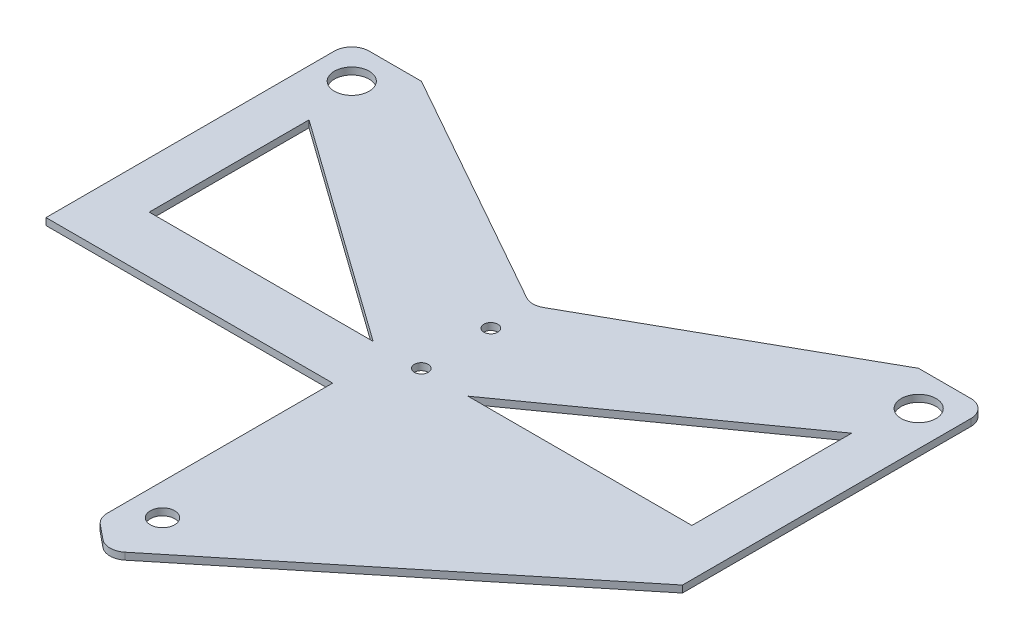
ISO-10303-21;
HEADER;
FILE_DESCRIPTION(('STEP AP214'),'2;1');
FILE_NAME('part.step','',(''),(''),'','','');
FILE_SCHEMA(('AUTOMOTIVE_DESIGN { 1 0 10303 214 1 1 1 1 }'));
ENDSEC;
DATA;
#1=APPLICATION_CONTEXT('core data for automotive mechanical design processes');
#2=APPLICATION_PROTOCOL_DEFINITION('international standard','automotive_design',2000,#1);
#3=PRODUCT_CONTEXT('',#1,'mechanical');
#4=PRODUCT('Part','Part','',(#3));
#5=PRODUCT_RELATED_PRODUCT_CATEGORY('part','',(#4));
#6=PRODUCT_DEFINITION_FORMATION('','',#4);
#7=PRODUCT_DEFINITION_CONTEXT('part definition',#1,'design');
#8=PRODUCT_DEFINITION('design','',#6,#7);
#9=PRODUCT_DEFINITION_SHAPE('','',#8);
#10=(LENGTH_UNIT() NAMED_UNIT(*) SI_UNIT(.MILLI.,.METRE.));
#11=(NAMED_UNIT(*) PLANE_ANGLE_UNIT() SI_UNIT($,.RADIAN.));
#12=(NAMED_UNIT(*) SI_UNIT($,.STERADIAN.) SOLID_ANGLE_UNIT());
#13=UNCERTAINTY_MEASURE_WITH_UNIT(LENGTH_MEASURE(1.E-05),#10,'distance_accuracy_value','');
#14=(GEOMETRIC_REPRESENTATION_CONTEXT(3) GLOBAL_UNCERTAINTY_ASSIGNED_CONTEXT((#13)) GLOBAL_UNIT_ASSIGNED_CONTEXT((#10,
#11,#12)) REPRESENTATION_CONTEXT('',''));
#15=CARTESIAN_POINT('',(0.,0.,0.));
#16=DIRECTION('',(0.,0.,1.));
#17=DIRECTION('',(1.,0.,0.));
#18=AXIS2_PLACEMENT_3D('',#15,#16,#17);
#19=CARTESIAN_POINT('',(0.,0.,-3.79380550980765));
#20=DIRECTION('',(0.,1.,0.));
#21=DIRECTION('',(-1.,0.,0.));
#22=AXIS2_PLACEMENT_3D('',#19,#20,#21);
#23=PLANE('',#22);
#24=CARTESIAN_POINT('',(0.,-1.04083408558608E-13,27.2061944901924));
#25=DIRECTION('',(0.,1.,0.));
#26=DIRECTION('',(-1.,0.,0.));
#27=AXIS2_PLACEMENT_3D('',#24,#25,#26);
#28=CIRCLE('',#27,1.75);
#29=CARTESIAN_POINT('',(-1.75,-1.04083408558608E-13,27.2061944901924));
#30=VERTEX_POINT('',#29);
#31=EDGE_CURVE('E290',#30,#30,#28,.T.);
#32=ORIENTED_EDGE('',*,*,#31,.T.);
#33=EDGE_LOOP('',(#32));
#34=FACE_BOUND('',#33,.T.);
#35=DIRECTION('',(0.775274546322448,0.,-0.63162439616003));
#36=VECTOR('',#35,1.);
#37=CARTESIAN_POINT('',(19.2312986698302,0.,19.8112617454897));
#38=LINE('',#37,#36);
#39=CARTESIAN_POINT('',(1.57906099040009,-1.29236898960272E-13,34.1927270187042));
#40=VERTEX_POINT('',#39);
#41=CARTESIAN_POINT('',(45.75,0.,-1.79380550980766));
#42=VERTEX_POINT('',#41);
#43=EDGE_CURVE('E267',#40,#42,#38,.T.);
#44=ORIENTED_EDGE('',*,*,#43,.F.);
#45=CARTESIAN_POINT('',(0.,-1.22298005056365E-13,32.2545406528981));
#46=DIRECTION('',(0.,1.,0.));
#47=DIRECTION('',(-1.,0.,0.));
#48=AXIS2_PLACEMENT_3D('',#45,#46,#47);
#49=CIRCLE('',#48,2.5);
#50=CARTESIAN_POINT('',(-1.57906099040009,-1.29236898960272E-13,34.1927270187042));
#51=VERTEX_POINT('',#50);
#52=EDGE_CURVE('E253',#51,#40,#49,.T.);
#53=ORIENTED_EDGE('',*,*,#52,.F.);
#54=DIRECTION('',(0.775274546322448,0.,0.63162439616003));
#55=VECTOR('',#54,1.);
#56=CARTESIAN_POINT('',(-3.61720845473632,-1.23165366794353E-13,32.5322266610528));
#57=LINE('',#56,#55);
#58=CARTESIAN_POINT('',(-3.61720845473632,-1.23165366794353E-13,32.5322266610528));
#59=VERTEX_POINT('',#58);
#60=EDGE_CURVE('E256',#59,#51,#57,.T.);
#61=ORIENTED_EDGE('',*,*,#60,.F.);
#62=CARTESIAN_POINT('',(-2.03814746433627,-1.15792792021452E-13,30.5940402952466));
#63=DIRECTION('',(0.,1.,0.));
#64=DIRECTION('',(-1.,0.,0.));
#65=AXIS2_PLACEMENT_3D('',#62,#63,#64);
#66=CIRCLE('',#65,2.5);
#67=CARTESIAN_POINT('',(-4.53814746433627,-1.15792792021452E-13,30.5940402952466));
#68=VERTEX_POINT('',#67);
#69=EDGE_CURVE('E275',#59,#68,#66,.F.);
#70=ORIENTED_EDGE('',*,*,#69,.T.);
#71=DIRECTION('',(0.,0.,-1.));
#72=VECTOR('',#71,1.);
#73=CARTESIAN_POINT('',(-4.53814746433628,0.,-3.79380550980765));
#74=LINE('',#73,#72);
#75=CARTESIAN_POINT('',(-4.53814746433628,0.,-1.79380550980766));
#76=VERTEX_POINT('',#75);
#77=EDGE_CURVE('E280',#68,#76,#74,.T.);
#78=ORIENTED_EDGE('',*,*,#77,.T.);
#79=DIRECTION('',(1.,0.,0.));
#80=VECTOR('',#79,1.);
#81=CARTESIAN_POINT('',(45.75,0.,-1.79380550980766));
#82=LINE('',#81,#80);
#83=CARTESIAN_POINT('',(-45.75,0.,-1.79380550980766));
#84=VERTEX_POINT('',#83);
#85=EDGE_CURVE('E65',#84,#76,#82,.T.);
#86=ORIENTED_EDGE('',*,*,#85,.F.);
#87=DIRECTION('',(0.,0.,1.));
#88=VECTOR('',#87,1.);
#89=CARTESIAN_POINT('',(-45.75,0.,-2.97190275490383));
#90=LINE('',#89,#88);
#91=CARTESIAN_POINT('',(-45.75,0.,-43.25));
#92=VERTEX_POINT('',#91);
#93=EDGE_CURVE('E202',#92,#84,#90,.T.);
#94=ORIENTED_EDGE('',*,*,#93,.F.);
#95=CARTESIAN_POINT('',(-43.25,0.,-43.25));
#96=DIRECTION('',(0.,1.,0.));
#97=DIRECTION('',(0.,0.,1.));
#98=AXIS2_PLACEMENT_3D('',#95,#96,#97);
#99=CIRCLE('',#98,2.5);
#100=CARTESIAN_POINT('',(-43.25,0.,-45.75));
#101=VERTEX_POINT('',#100);
#102=EDGE_CURVE('E207',#101,#92,#99,.T.);
#103=ORIENTED_EDGE('',*,*,#102,.F.);
#104=DIRECTION('',(1.,0.,0.));
#105=VECTOR('',#104,1.);
#106=CARTESIAN_POINT('',(-43.25,0.,-45.75));
#107=LINE('',#106,#105);
#108=CARTESIAN_POINT('',(-35.737250175444,0.,-45.75));
#109=VERTEX_POINT('',#108);
#110=EDGE_CURVE('E220',#109,#101,#107,.F.);
#111=ORIENTED_EDGE('',*,*,#110,.F.);
#112=DIRECTION('',(-0.87190213853743,0.,-0.4896801617524));
#113=VECTOR('',#112,1.);
#114=CARTESIAN_POINT('',(-40.3811598554617,0.,-48.3581257778415));
#115=LINE('',#114,#113);
#116=CARTESIAN_POINT('',(-1.22420040438101,0.,-26.3666827130253));
#117=VERTEX_POINT('',#116);
#118=EDGE_CURVE('E371',#117,#109,#115,.T.);
#119=ORIENTED_EDGE('',*,*,#118,.F.);
#120=CARTESIAN_POINT('',(0.,0.,-28.5464380593689));
#121=DIRECTION('',(0.,-1.,0.));
#122=DIRECTION('',(0.,0.,-1.));
#123=AXIS2_PLACEMENT_3D('',#120,#121,#122);
#124=CIRCLE('',#123,2.5);
#125=CARTESIAN_POINT('',(1.22420040438101,0.,-26.3666827130253));
#126=VERTEX_POINT('',#125);
#127=EDGE_CURVE('E246',#126,#117,#124,.T.);
#128=ORIENTED_EDGE('',*,*,#127,.F.);
#129=DIRECTION('',(-0.87190213853743,0.,0.4896801617524));
#130=VECTOR('',#129,1.);
#131=CARTESIAN_POINT('',(-25.3772939841398,0.,-11.4266756878364));
#132=LINE('',#131,#130);
#133=CARTESIAN_POINT('',(35.737250175444,0.,-45.75));
#134=VERTEX_POINT('',#133);
#135=EDGE_CURVE('E241',#134,#126,#132,.T.);
#136=ORIENTED_EDGE('',*,*,#135,.F.);
#137=CARTESIAN_POINT('',(43.25,0.,-45.75));
#138=VERTEX_POINT('',#137);
#139=EDGE_CURVE('E237',#138,#134,#107,.F.);
#140=ORIENTED_EDGE('',*,*,#139,.F.);
#141=CARTESIAN_POINT('',(43.25,0.,-43.25));
#142=DIRECTION('',(0.,1.,0.));
#143=DIRECTION('',(0.,0.,1.));
#144=AXIS2_PLACEMENT_3D('',#141,#142,#143);
#145=CIRCLE('',#144,2.5);
#146=CARTESIAN_POINT('',(45.75,0.,-43.25));
#147=VERTEX_POINT('',#146);
#148=EDGE_CURVE('E228',#147,#138,#145,.T.);
#149=ORIENTED_EDGE('',*,*,#148,.F.);
#150=DIRECTION('',(0.,0.,1.));
#151=VECTOR('',#150,1.);
#152=CARTESIAN_POINT('',(45.75,0.,-2.97190275490383));
#153=LINE('',#152,#151);
#154=EDGE_CURVE('E209',#42,#147,#153,.F.);
#155=ORIENTED_EDGE('',*,*,#154,.F.);
#156=EDGE_LOOP('',(#44,#53,#61,#70,#78,#86,#94,#103,#111,#119,#128,#136,#140,#149,#155));
#157=FACE_BOUND('',#156,.T.);
#158=DIRECTION('',(-0.813936751097687,0.,0.580953496600668));
#159=VECTOR('',#158,1.);
#160=CARTESIAN_POINT('',(6.81673799323512,0.,-9.88989745885505));
#161=LINE('',#160,#159);
#162=CARTESIAN_POINT('',(39.0092276891494,0.,-32.8675298460155));
#163=VERTEX_POINT('',#162);
#164=CARTESIAN_POINT('',(6.81673799323512,0.,-9.88989745885505));
#165=VERTEX_POINT('',#164);
#166=EDGE_CURVE('E399',#163,#165,#161,.T.);
#167=ORIENTED_EDGE('',*,*,#166,.T.);
#168=DIRECTION('',(1.,0.,0.));
#169=VECTOR('',#168,1.);
#170=CARTESIAN_POINT('',(-43.25,0.,-9.88989745885505));
#171=LINE('',#170,#169);
#172=CARTESIAN_POINT('',(39.0092276891494,0.,-9.88989745885505));
#173=VERTEX_POINT('',#172);
#174=EDGE_CURVE('E836',#165,#173,#171,.T.);
#175=ORIENTED_EDGE('',*,*,#174,.T.);
#176=DIRECTION('',(0.,0.,-1.));
#177=VECTOR('',#176,1.);
#178=CARTESIAN_POINT('',(39.0092276891494,0.,-43.25));
#179=LINE('',#178,#177);
#180=EDGE_CURVE('E838',#173,#163,#179,.T.);
#181=ORIENTED_EDGE('',*,*,#180,.T.);
#182=EDGE_LOOP('',(#167,#175,#181));
#183=FACE_BOUND('',#182,.T.);
#184=CARTESIAN_POINT('',(-40.75,0.,-40.75));
#185=DIRECTION('',(0.,1.,0.));
#186=DIRECTION('',(0.,0.,1.));
#187=AXIS2_PLACEMENT_3D('',#184,#185,#186);
#188=CIRCLE('',#187,2.5);
#189=CARTESIAN_POINT('',(-40.75,0.,-38.25));
#190=VERTEX_POINT('',#189);
#191=EDGE_CURVE('E840',#190,#190,#188,.T.);
#192=ORIENTED_EDGE('',*,*,#191,.T.);
#193=EDGE_LOOP('',(#192));
#194=FACE_BOUND('',#193,.T.);
#195=CARTESIAN_POINT('',(40.75,0.,-40.75));
#196=DIRECTION('',(0.,1.,0.));
#197=DIRECTION('',(0.,0.,1.));
#198=AXIS2_PLACEMENT_3D('',#195,#196,#197);
#199=CIRCLE('',#198,2.5);
#200=CARTESIAN_POINT('',(40.75,0.,-38.25));
#201=VERTEX_POINT('',#200);
#202=EDGE_CURVE('E845',#201,#201,#199,.T.);
#203=ORIENTED_EDGE('',*,*,#202,.T.);
#204=EDGE_LOOP('',(#203));
#205=FACE_BOUND('',#204,.T.);
#206=DIRECTION('',(1.,0.,0.));
#207=VECTOR('',#206,1.);
#208=CARTESIAN_POINT('',(-43.25,0.,-9.88989745885505));
#209=LINE('',#208,#207);
#210=CARTESIAN_POINT('',(-39.0092276891494,0.,-9.88989745885505));
#211=VERTEX_POINT('',#210);
#212=CARTESIAN_POINT('',(-6.81673799323512,0.,-9.88989745885505));
#213=VERTEX_POINT('',#212);
#214=EDGE_CURVE('E848',#211,#213,#209,.T.);
#215=ORIENTED_EDGE('',*,*,#214,.T.);
#216=DIRECTION('',(-0.813936751097687,0.,-0.580953496600668));
#217=VECTOR('',#216,1.);
#218=CARTESIAN_POINT('',(-6.81673799323512,0.,-9.88989745885505));
#219=LINE('',#218,#217);
#220=CARTESIAN_POINT('',(-39.0092276891494,0.,-32.8675298460155));
#221=VERTEX_POINT('',#220);
#222=EDGE_CURVE('E851',#213,#221,#219,.T.);
#223=ORIENTED_EDGE('',*,*,#222,.T.);
#224=DIRECTION('',(0.,0.,-1.));
#225=VECTOR('',#224,1.);
#226=CARTESIAN_POINT('',(-39.0092276891494,0.,-43.25));
#227=LINE('',#226,#225);
#228=EDGE_CURVE('E210',#221,#211,#227,.F.);
#229=ORIENTED_EDGE('',*,*,#228,.T.);
#230=EDGE_LOOP('',(#215,#223,#229));
#231=FACE_BOUND('',#230,.T.);
#232=CARTESIAN_POINT('',(-4.62608795714914E-06,0.,-10.0000000957812));
#233=DIRECTION('',(0.,-1.,0.));
#234=DIRECTION('',(0.,0.,-1.));
#235=AXIS2_PLACEMENT_3D('',#232,#233,#234);
#236=CIRCLE('',#235,1.);
#237=CARTESIAN_POINT('',(-4.62608795714914E-06,0.,-11.0000000957812));
#238=VERTEX_POINT('',#237);
#239=EDGE_CURVE('E360',#238,#238,#236,.T.);
#240=ORIENTED_EDGE('',*,*,#239,.F.);
#241=EDGE_LOOP('',(#240));
#242=FACE_BOUND('',#241,.T.);
#243=CARTESIAN_POINT('',(-4.62608795714914E-06,0.,-20.0000000957812));
#244=DIRECTION('',(0.,-1.,0.));
#245=DIRECTION('',(0.,0.,-1.));
#246=AXIS2_PLACEMENT_3D('',#243,#244,#245);
#247=CIRCLE('',#246,1.);
#248=CARTESIAN_POINT('',(-4.62608795714914E-06,0.,-21.0000000957812));
#249=VERTEX_POINT('',#248);
#250=EDGE_CURVE('E361',#249,#249,#247,.T.);
#251=ORIENTED_EDGE('',*,*,#250,.F.);
#252=EDGE_LOOP('',(#251));
#253=FACE_BOUND('',#252,.T.);
#254=ADVANCED_FACE('F61',(#34,#157,#183,#194,#205,#231,#242,#253),#23,.F.);
#255=CARTESIAN_POINT('',(-43.25,1.,-43.25));
#256=DIRECTION('',(0.,-1.,0.));
#257=DIRECTION('',(0.,0.,-1.));
#258=AXIS2_PLACEMENT_3D('',#255,#256,#257);
#259=PLANE('',#258);
#260=CARTESIAN_POINT('',(0.,0.999999999999895,27.2061944901924));
#261=DIRECTION('',(0.,1.,0.));
#262=DIRECTION('',(-1.,0.,0.));
#263=AXIS2_PLACEMENT_3D('',#260,#261,#262);
#264=CIRCLE('',#263,1.75);
#265=CARTESIAN_POINT('',(-1.75,0.999999999999895,27.2061944901924));
#266=VERTEX_POINT('',#265);
#267=EDGE_CURVE('E287',#266,#266,#264,.T.);
#268=ORIENTED_EDGE('',*,*,#267,.F.);
#269=EDGE_LOOP('',(#268));
#270=FACE_BOUND('',#269,.T.);
#271=CARTESIAN_POINT('',(-2.03814746433627,0.999999999999884,30.5940402952466));
#272=DIRECTION('',(0.,1.,0.));
#273=DIRECTION('',(-1.,0.,0.));
#274=AXIS2_PLACEMENT_3D('',#271,#272,#273);
#275=CIRCLE('',#274,2.5);
#276=CARTESIAN_POINT('',(-3.61720845473632,0.999999999999877,32.5322266610528));
#277=VERTEX_POINT('',#276);
#278=CARTESIAN_POINT('',(-4.53814746433627,0.999999999999883,30.5940402952466));
#279=VERTEX_POINT('',#278);
#280=EDGE_CURVE('E277',#277,#279,#275,.F.);
#281=ORIENTED_EDGE('',*,*,#280,.F.);
#282=DIRECTION('',(0.775274546322448,0.,0.63162439616003));
#283=VECTOR('',#282,1.);
#284=CARTESIAN_POINT('',(-3.61720845473632,0.999999999999877,32.5322266610528));
#285=LINE('',#284,#283);
#286=CARTESIAN_POINT('',(-1.57906099040009,0.999999999999871,34.1927270187042));
#287=VERTEX_POINT('',#286);
#288=EDGE_CURVE('E257',#277,#287,#285,.T.);
#289=ORIENTED_EDGE('',*,*,#288,.T.);
#290=CARTESIAN_POINT('',(0.,0.999999999999878,32.2545406528981));
#291=DIRECTION('',(0.,1.,0.));
#292=DIRECTION('',(-1.,0.,0.));
#293=AXIS2_PLACEMENT_3D('',#290,#291,#292);
#294=CIRCLE('',#293,2.5);
#295=CARTESIAN_POINT('',(1.57906099040009,0.999999999999871,34.1927270187042));
#296=VERTEX_POINT('',#295);
#297=EDGE_CURVE('E250',#287,#296,#294,.T.);
#298=ORIENTED_EDGE('',*,*,#297,.T.);
#299=DIRECTION('',(0.775274546322448,0.,-0.63162439616003));
#300=VECTOR('',#299,1.);
#301=CARTESIAN_POINT('',(19.2312986698302,0.999999999999921,19.8112617454898));
#302=LINE('',#301,#300);
#303=CARTESIAN_POINT('',(45.75,0.999999999999997,-1.79380550980765));
#304=VERTEX_POINT('',#303);
#305=EDGE_CURVE('E273',#296,#304,#302,.T.);
#306=ORIENTED_EDGE('',*,*,#305,.T.);
#307=DIRECTION('',(0.,0.,1.));
#308=VECTOR('',#307,1.);
#309=CARTESIAN_POINT('',(45.75,0.999999999999997,-2.97190275490383));
#310=LINE('',#309,#308);
#311=CARTESIAN_POINT('',(45.75,1.,-43.25));
#312=VERTEX_POINT('',#311);
#313=EDGE_CURVE('E249',#304,#312,#310,.F.);
#314=ORIENTED_EDGE('',*,*,#313,.T.);
#315=CARTESIAN_POINT('',(43.25,1.,-43.25));
#316=DIRECTION('',(0.,1.,0.));
#317=DIRECTION('',(0.,0.,1.));
#318=AXIS2_PLACEMENT_3D('',#315,#316,#317);
#319=CIRCLE('',#318,2.5);
#320=CARTESIAN_POINT('',(43.25,1.,-45.75));
#321=VERTEX_POINT('',#320);
#322=EDGE_CURVE('E406',#312,#321,#319,.T.);
#323=ORIENTED_EDGE('',*,*,#322,.T.);
#324=DIRECTION('',(-1.,0.,0.));
#325=VECTOR('',#324,1.);
#326=CARTESIAN_POINT('',(43.25,1.,-45.75));
#327=LINE('',#326,#325);
#328=CARTESIAN_POINT('',(35.737250175444,1.,-45.75));
#329=VERTEX_POINT('',#328);
#330=EDGE_CURVE('E401',#321,#329,#327,.T.);
#331=ORIENTED_EDGE('',*,*,#330,.T.);
#332=DIRECTION('',(-0.87190213853743,0.,0.4896801617524));
#333=VECTOR('',#332,1.);
#334=CARTESIAN_POINT('',(-25.3772939841398,1.,-11.4266756878364));
#335=LINE('',#334,#333);
#336=CARTESIAN_POINT('',(1.22420040438101,1.,-26.3666827130253));
#337=VERTEX_POINT('',#336);
#338=EDGE_CURVE('E395',#329,#337,#335,.T.);
#339=ORIENTED_EDGE('',*,*,#338,.T.);
#340=CARTESIAN_POINT('',(0.,1.,-28.5464380593689));
#341=DIRECTION('',(0.,-1.,0.));
#342=DIRECTION('',(0.,0.,-1.));
#343=AXIS2_PLACEMENT_3D('',#340,#341,#342);
#344=CIRCLE('',#343,2.5);
#345=CARTESIAN_POINT('',(-1.22420040438101,1.,-26.3666827130253));
#346=VERTEX_POINT('',#345);
#347=EDGE_CURVE('E392',#337,#346,#344,.T.);
#348=ORIENTED_EDGE('',*,*,#347,.T.);
#349=DIRECTION('',(-0.87190213853743,0.,-0.4896801617524));
#350=VECTOR('',#349,1.);
#351=CARTESIAN_POINT('',(-40.3811598554617,1.,-48.3581257778415));
#352=LINE('',#351,#350);
#353=CARTESIAN_POINT('',(-35.737250175444,1.,-45.75));
#354=VERTEX_POINT('',#353);
#355=EDGE_CURVE('E387',#346,#354,#352,.T.);
#356=ORIENTED_EDGE('',*,*,#355,.T.);
#357=CARTESIAN_POINT('',(-43.25,1.,-45.75));
#358=VERTEX_POINT('',#357);
#359=EDGE_CURVE('E407',#354,#358,#327,.T.);
#360=ORIENTED_EDGE('',*,*,#359,.T.);
#361=CARTESIAN_POINT('',(-43.25,1.,-43.25));
#362=DIRECTION('',(0.,1.,0.));
#363=DIRECTION('',(0.,0.,-1.));
#364=AXIS2_PLACEMENT_3D('',#361,#362,#363);
#365=CIRCLE('',#364,2.5);
#366=CARTESIAN_POINT('',(-45.75,1.,-43.25));
#367=VERTEX_POINT('',#366);
#368=EDGE_CURVE('E410',#358,#367,#365,.T.);
#369=ORIENTED_EDGE('',*,*,#368,.T.);
#370=DIRECTION('',(0.,0.,1.));
#371=VECTOR('',#370,1.);
#372=CARTESIAN_POINT('',(-45.75,0.999999999999997,-2.97190275490383));
#373=LINE('',#372,#371);
#374=CARTESIAN_POINT('',(-45.75,0.999999999999997,-1.79380550980765));
#375=VERTEX_POINT('',#374);
#376=EDGE_CURVE('E216',#367,#375,#373,.T.);
#377=ORIENTED_EDGE('',*,*,#376,.T.);
#378=DIRECTION('',(1.,0.,0.));
#379=VECTOR('',#378,1.);
#380=CARTESIAN_POINT('',(-45.75,0.999999999999997,-1.79380550980765));
#381=LINE('',#380,#379);
#382=CARTESIAN_POINT('',(-4.53814746433628,0.999999999999997,-1.79380550980766));
#383=VERTEX_POINT('',#382);
#384=EDGE_CURVE('E13',#375,#383,#381,.T.);
#385=ORIENTED_EDGE('',*,*,#384,.T.);
#386=DIRECTION('',(0.,0.,1.));
#387=VECTOR('',#386,1.);
#388=CARTESIAN_POINT('',(-4.53814746433627,1.,-3.79380550980764));
#389=LINE('',#388,#387);
#390=EDGE_CURVE('E279',#279,#383,#389,.F.);
#391=ORIENTED_EDGE('',*,*,#390,.F.);
#392=EDGE_LOOP('',(#281,#289,#298,#306,#314,#323,#331,#339,#348,#356,#360,#369,#377,#385,#391));
#393=FACE_BOUND('',#392,.T.);
#394=DIRECTION('',(-0.813936751097687,0.,0.580953496600668));
#395=VECTOR('',#394,1.);
#396=CARTESIAN_POINT('',(6.81673799323512,1.,-9.88989745885505));
#397=LINE('',#396,#395);
#398=CARTESIAN_POINT('',(39.0092276891494,1.,-32.8675298460155));
#399=VERTEX_POINT('',#398);
#400=CARTESIAN_POINT('',(6.81673799323512,1.,-9.88989745885505));
#401=VERTEX_POINT('',#400);
#402=EDGE_CURVE('E335',#399,#401,#397,.T.);
#403=ORIENTED_EDGE('',*,*,#402,.F.);
#404=DIRECTION('',(0.,0.,-1.));
#405=VECTOR('',#404,1.);
#406=CARTESIAN_POINT('',(39.0092276891494,1.,-32.8675298460155));
#407=LINE('',#406,#405);
#408=CARTESIAN_POINT('',(39.0092276891494,1.,-9.88989745885505));
#409=VERTEX_POINT('',#408);
#410=EDGE_CURVE('E416',#409,#399,#407,.T.);
#411=ORIENTED_EDGE('',*,*,#410,.F.);
#412=DIRECTION('',(1.,0.,0.));
#413=VECTOR('',#412,1.);
#414=CARTESIAN_POINT('',(39.0092276891494,1.,-9.88989745885505));
#415=LINE('',#414,#413);
#416=EDGE_CURVE('E420',#401,#409,#415,.T.);
#417=ORIENTED_EDGE('',*,*,#416,.F.);
#418=EDGE_LOOP('',(#403,#411,#417));
#419=FACE_BOUND('',#418,.T.);
#420=CARTESIAN_POINT('',(-40.75,1.,-40.75));
#421=DIRECTION('',(0.,1.,0.));
#422=DIRECTION('',(0.,0.,-1.));
#423=AXIS2_PLACEMENT_3D('',#420,#421,#422);
#424=CIRCLE('',#423,2.5);
#425=CARTESIAN_POINT('',(-40.75,1.,-43.25));
#426=VERTEX_POINT('',#425);
#427=EDGE_CURVE('E340',#426,#426,#424,.T.);
#428=ORIENTED_EDGE('',*,*,#427,.F.);
#429=EDGE_LOOP('',(#428));
#430=FACE_BOUND('',#429,.T.);
#431=CARTESIAN_POINT('',(40.75,1.,-40.75));
#432=DIRECTION('',(0.,1.,0.));
#433=DIRECTION('',(0.,0.,1.));
#434=AXIS2_PLACEMENT_3D('',#431,#432,#433);
#435=CIRCLE('',#434,2.5);
#436=CARTESIAN_POINT('',(40.75,1.,-38.25));
#437=VERTEX_POINT('',#436);
#438=EDGE_CURVE('E344',#437,#437,#435,.T.);
#439=ORIENTED_EDGE('',*,*,#438,.F.);
#440=EDGE_LOOP('',(#439));
#441=FACE_BOUND('',#440,.T.);
#442=DIRECTION('',(1.,0.,0.));
#443=VECTOR('',#442,1.);
#444=CARTESIAN_POINT('',(-39.0092276891494,1.,-9.88989745885505));
#445=LINE('',#444,#443);
#446=CARTESIAN_POINT('',(-39.0092276891494,1.,-9.88989745885505));
#447=VERTEX_POINT('',#446);
#448=CARTESIAN_POINT('',(-6.81673799323512,1.,-9.88989745885505));
#449=VERTEX_POINT('',#448);
#450=EDGE_CURVE('E350',#447,#449,#445,.T.);
#451=ORIENTED_EDGE('',*,*,#450,.F.);
#452=DIRECTION('',(0.,0.,1.));
#453=VECTOR('',#452,1.);
#454=CARTESIAN_POINT('',(-39.0092276891494,1.,-32.8675298460155));
#455=LINE('',#454,#453);
#456=CARTESIAN_POINT('',(-39.0092276891494,1.,-32.8675298460155));
#457=VERTEX_POINT('',#456);
#458=EDGE_CURVE('E430',#457,#447,#455,.T.);
#459=ORIENTED_EDGE('',*,*,#458,.F.);
#460=DIRECTION('',(-0.813936751097687,0.,-0.580953496600668));
#461=VECTOR('',#460,1.);
#462=CARTESIAN_POINT('',(-6.81673799323512,1.,-9.88989745885505));
#463=LINE('',#462,#461);
#464=EDGE_CURVE('E434',#449,#457,#463,.T.);
#465=ORIENTED_EDGE('',*,*,#464,.F.);
#466=EDGE_LOOP('',(#451,#459,#465));
#467=FACE_BOUND('',#466,.T.);
#468=CARTESIAN_POINT('',(-4.62608795714914E-06,1.,-10.0000000957812));
#469=DIRECTION('',(0.,1.,0.));
#470=DIRECTION('',(0.,0.,1.));
#471=AXIS2_PLACEMENT_3D('',#468,#469,#470);
#472=CIRCLE('',#471,1.);
#473=CARTESIAN_POINT('',(-4.62608795714914E-06,1.,-9.00000009578116));
#474=VERTEX_POINT('',#473);
#475=EDGE_CURVE('E355',#474,#474,#472,.T.);
#476=ORIENTED_EDGE('',*,*,#475,.F.);
#477=EDGE_LOOP('',(#476));
#478=FACE_BOUND('',#477,.T.);
#479=CARTESIAN_POINT('',(-4.62608795714914E-06,1.,-20.0000000957812));
#480=DIRECTION('',(0.,1.,0.));
#481=DIRECTION('',(0.,0.,1.));
#482=AXIS2_PLACEMENT_3D('',#479,#480,#481);
#483=CIRCLE('',#482,1.);
#484=CARTESIAN_POINT('',(-4.62608795714914E-06,1.,-19.0000000957812));
#485=VERTEX_POINT('',#484);
#486=EDGE_CURVE('E358',#485,#485,#483,.T.);
#487=ORIENTED_EDGE('',*,*,#486,.F.);
#488=EDGE_LOOP('',(#487));
#489=FACE_BOUND('',#488,.T.);
#490=ADVANCED_FACE('F63',(#270,#393,#419,#430,#441,#467,#478,#489),#259,.F.);
#491=CARTESIAN_POINT('',(0.,-9.0000000000001,27.2061944901923));
#492=DIRECTION('',(0.,1.,0.));
#493=DIRECTION('',(-1.,0.,0.));
#494=AXIS2_PLACEMENT_3D('',#491,#492,#493);
#495=CYLINDRICAL_SURFACE('',#494,1.75);
#496=ORIENTED_EDGE('',*,*,#267,.T.);
#497=EDGE_LOOP('',(#496));
#498=FACE_BOUND('',#497,.T.);
#499=ORIENTED_EDGE('',*,*,#31,.F.);
#500=EDGE_LOOP('',(#499));
#501=FACE_BOUND('',#500,.T.);
#502=ADVANCED_FACE('F307',(#498,#501),#495,.F.);
#503=CARTESIAN_POINT('',(45.75,0.,-1.79380550980766));
#504=DIRECTION('',(0.,0.,1.));
#505=DIRECTION('',(1.,0.,0.));
#506=AXIS2_PLACEMENT_3D('',#503,#504,#505);
#507=PLANE('',#506);
#508=DIRECTION('',(0.,-1.,0.));
#509=VECTOR('',#508,1.);
#510=CARTESIAN_POINT('',(-45.75,0.,-1.79380550980766));
#511=LINE('',#510,#509);
#512=EDGE_CURVE('E70',#375,#84,#511,.T.);
#513=ORIENTED_EDGE('',*,*,#512,.T.);
#514=ORIENTED_EDGE('',*,*,#85,.T.);
#515=DIRECTION('',(0.,-1.,0.));
#516=VECTOR('',#515,1.);
#517=CARTESIAN_POINT('',(-4.53814746433628,0.,-1.79380550980766));
#518=LINE('',#517,#516);
#519=EDGE_CURVE('E286',#76,#383,#518,.F.);
#520=ORIENTED_EDGE('',*,*,#519,.T.);
#521=ORIENTED_EDGE('',*,*,#384,.F.);
#522=EDGE_LOOP('',(#513,#514,#520,#521));
#523=FACE_BOUND('',#522,.T.);
#524=ADVANCED_FACE('F305',(#523),#507,.T.);
#525=CARTESIAN_POINT('',(-4.53814746433628,0.,-3.79380550980765));
#526=DIRECTION('',(1.,0.,0.));
#527=DIRECTION('',(0.,0.,-1.));
#528=AXIS2_PLACEMENT_3D('',#525,#526,#527);
#529=PLANE('',#528);
#530=ORIENTED_EDGE('',*,*,#519,.F.);
#531=ORIENTED_EDGE('',*,*,#77,.F.);
#532=DIRECTION('',(0.,-1.,0.));
#533=VECTOR('',#532,1.);
#534=CARTESIAN_POINT('',(-4.53814746433627,-1.15792792021452E-13,30.5940402952466));
#535=LINE('',#534,#533);
#536=EDGE_CURVE('E283',#68,#279,#535,.F.);
#537=ORIENTED_EDGE('',*,*,#536,.T.);
#538=ORIENTED_EDGE('',*,*,#390,.T.);
#539=EDGE_LOOP('',(#530,#531,#537,#538));
#540=FACE_BOUND('',#539,.T.);
#541=ADVANCED_FACE('F303',(#540),#529,.F.);
#542=CARTESIAN_POINT('',(-2.03814746433627,-1.15792792021452E-13,30.5940402952466));
#543=DIRECTION('',(0.,1.,0.));
#544=DIRECTION('',(-1.,0.,0.));
#545=AXIS2_PLACEMENT_3D('',#542,#543,#544);
#546=CYLINDRICAL_SURFACE('',#545,2.5);
#547=ORIENTED_EDGE('',*,*,#536,.F.);
#548=ORIENTED_EDGE('',*,*,#69,.F.);
#549=DIRECTION('',(0.,1.,0.));
#550=VECTOR('',#549,1.);
#551=CARTESIAN_POINT('',(-3.61720845473632,-1.23165366794353E-13,32.5322266610528));
#552=LINE('',#551,#550);
#553=EDGE_CURVE('E268',#59,#277,#552,.T.);
#554=ORIENTED_EDGE('',*,*,#553,.T.);
#555=ORIENTED_EDGE('',*,*,#280,.T.);
#556=EDGE_LOOP('',(#547,#548,#554,#555));
#557=FACE_BOUND('',#556,.T.);
#558=ADVANCED_FACE('F313',(#557),#546,.T.);
#559=CARTESIAN_POINT('',(19.2312986698302,0.,19.8112617454897));
#560=DIRECTION('',(0.63162439616003,0.,0.775274546322448));
#561=DIRECTION('',(0.775274546322448,0.,-0.63162439616003));
#562=AXIS2_PLACEMENT_3D('',#559,#560,#561);
#563=PLANE('',#562);
#564=ORIENTED_EDGE('',*,*,#43,.T.);
#565=DIRECTION('',(0.,-1.,0.));
#566=VECTOR('',#565,1.);
#567=CARTESIAN_POINT('',(45.75,0.999999999999993,-1.79380550980765));
#568=LINE('',#567,#566);
#569=EDGE_CURVE('E293',#304,#42,#568,.T.);
#570=ORIENTED_EDGE('',*,*,#569,.F.);
#571=ORIENTED_EDGE('',*,*,#305,.F.);
#572=DIRECTION('',(0.,1.,0.));
#573=VECTOR('',#572,1.);
#574=CARTESIAN_POINT('',(1.57906099040009,-1.29236898960272E-13,34.1927270187042));
#575=LINE('',#574,#573);
#576=EDGE_CURVE('E260',#40,#296,#575,.T.);
#577=ORIENTED_EDGE('',*,*,#576,.F.);
#578=EDGE_LOOP('',(#564,#570,#571,#577));
#579=FACE_BOUND('',#578,.T.);
#580=ADVANCED_FACE('F496',(#579),#563,.T.);
#581=CARTESIAN_POINT('',(0.,-1.22298005056365E-13,32.2545406528981));
#582=DIRECTION('',(0.,1.,0.));
#583=DIRECTION('',(-1.,0.,0.));
#584=AXIS2_PLACEMENT_3D('',#581,#582,#583);
#585=CYLINDRICAL_SURFACE('',#584,2.5);
#586=ORIENTED_EDGE('',*,*,#297,.F.);
#587=DIRECTION('',(0.,1.,0.));
#588=VECTOR('',#587,1.);
#589=CARTESIAN_POINT('',(-1.57906099040009,-1.29236898960272E-13,34.1927270187042));
#590=LINE('',#589,#588);
#591=EDGE_CURVE('E265',#51,#287,#590,.T.);
#592=ORIENTED_EDGE('',*,*,#591,.F.);
#593=ORIENTED_EDGE('',*,*,#52,.T.);
#594=ORIENTED_EDGE('',*,*,#576,.T.);
#595=EDGE_LOOP('',(#586,#592,#593,#594));
#596=FACE_BOUND('',#595,.T.);
#597=ADVANCED_FACE('F492',(#596),#585,.T.);
#598=CARTESIAN_POINT('',(-3.61720845473632,-1.23165366794353E-13,32.5322266610528));
#599=DIRECTION('',(-0.63162439616003,0.,0.775274546322448));
#600=DIRECTION('',(-0.775274546322448,0.,-0.63162439616003));
#601=AXIS2_PLACEMENT_3D('',#598,#599,#600);
#602=PLANE('',#601);
#603=ORIENTED_EDGE('',*,*,#288,.F.);
#604=ORIENTED_EDGE('',*,*,#553,.F.);
#605=ORIENTED_EDGE('',*,*,#60,.T.);
#606=ORIENTED_EDGE('',*,*,#591,.T.);
#607=EDGE_LOOP('',(#603,#604,#605,#606));
#608=FACE_BOUND('',#607,.T.);
#609=ADVANCED_FACE('F486',(#608),#602,.T.);
#610=CARTESIAN_POINT('',(-45.75,0.499999999999997,-2.97190275490383));
#611=DIRECTION('',(-1.,0.,0.));
#612=DIRECTION('',(0.,0.,1.));
#613=AXIS2_PLACEMENT_3D('',#610,#611,#612);
#614=PLANE('',#613);
#615=ORIENTED_EDGE('',*,*,#376,.F.);
#616=DIRECTION('',(0.,1.,0.));
#617=VECTOR('',#616,1.);
#618=CARTESIAN_POINT('',(-45.75,1.,-43.25));
#619=LINE('',#618,#617);
#620=EDGE_CURVE('E213',#92,#367,#619,.T.);
#621=ORIENTED_EDGE('',*,*,#620,.F.);
#622=ORIENTED_EDGE('',*,*,#93,.T.);
#623=ORIENTED_EDGE('',*,*,#512,.F.);
#624=EDGE_LOOP('',(#615,#621,#622,#623));
#625=FACE_BOUND('',#624,.T.);
#626=ADVANCED_FACE('F214',(#625),#614,.T.);
#627=CARTESIAN_POINT('',(45.75,0.499999999999997,-2.97190275490383));
#628=DIRECTION('',(-1.,0.,0.));
#629=DIRECTION('',(0.,0.,1.));
#630=AXIS2_PLACEMENT_3D('',#627,#628,#629);
#631=PLANE('',#630);
#632=ORIENTED_EDGE('',*,*,#154,.T.);
#633=DIRECTION('',(0.,1.,0.));
#634=VECTOR('',#633,1.);
#635=CARTESIAN_POINT('',(45.75,1.,-43.25));
#636=LINE('',#635,#634);
#637=EDGE_CURVE('E396',#147,#312,#636,.T.);
#638=ORIENTED_EDGE('',*,*,#637,.T.);
#639=ORIENTED_EDGE('',*,*,#313,.F.);
#640=ORIENTED_EDGE('',*,*,#569,.T.);
#641=EDGE_LOOP('',(#632,#638,#639,#640));
#642=FACE_BOUND('',#641,.T.);
#643=ADVANCED_FACE('F485',(#642),#631,.F.);
#644=CARTESIAN_POINT('',(0.,0.,-28.5464380593689));
#645=DIRECTION('',(0.,-1.,0.));
#646=DIRECTION('',(0.,0.,-1.));
#647=AXIS2_PLACEMENT_3D('',#644,#645,#646);
#648=CYLINDRICAL_SURFACE('',#647,2.5);
#649=DIRECTION('',(0.,-1.,0.));
#650=VECTOR('',#649,1.);
#651=CARTESIAN_POINT('',(1.22420040438101,0.,-26.3666827130253));
#652=LINE('',#651,#650);
#653=EDGE_CURVE('E238',#126,#337,#652,.F.);
#654=ORIENTED_EDGE('',*,*,#653,.F.);
#655=ORIENTED_EDGE('',*,*,#127,.T.);
#656=DIRECTION('',(0.,-1.,0.));
#657=VECTOR('',#656,1.);
#658=CARTESIAN_POINT('',(-1.22420040438101,0.,-26.3666827130253));
#659=LINE('',#658,#657);
#660=EDGE_CURVE('E243',#117,#346,#659,.F.);
#661=ORIENTED_EDGE('',*,*,#660,.T.);
#662=ORIENTED_EDGE('',*,*,#347,.F.);
#663=EDGE_LOOP('',(#654,#655,#661,#662));
#664=FACE_BOUND('',#663,.T.);
#665=ADVANCED_FACE('F391',(#664),#648,.F.);
#666=CARTESIAN_POINT('',(-25.3772939841398,0.,-11.4266756878364));
#667=DIRECTION('',(0.4896801617524,0.,0.87190213853743));
#668=DIRECTION('',(-0.87190213853743,0.,0.4896801617524));
#669=AXIS2_PLACEMENT_3D('',#666,#667,#668);
#670=PLANE('',#669);
#671=ORIENTED_EDGE('',*,*,#135,.T.);
#672=ORIENTED_EDGE('',*,*,#653,.T.);
#673=ORIENTED_EDGE('',*,*,#338,.F.);
#674=DIRECTION('',(0.,-1.,0.));
#675=VECTOR('',#674,1.);
#676=CARTESIAN_POINT('',(35.737250175444,0.,-45.75));
#677=LINE('',#676,#675);
#678=EDGE_CURVE('E234',#134,#329,#677,.F.);
#679=ORIENTED_EDGE('',*,*,#678,.F.);
#680=EDGE_LOOP('',(#671,#672,#673,#679));
#681=FACE_BOUND('',#680,.T.);
#682=ADVANCED_FACE('F519',(#681),#670,.F.);
#683=CARTESIAN_POINT('',(43.25,1.,-45.75));
#684=DIRECTION('',(0.,0.,1.));
#685=DIRECTION('',(-1.,0.,0.));
#686=AXIS2_PLACEMENT_3D('',#683,#684,#685);
#687=PLANE('',#686);
#688=ORIENTED_EDGE('',*,*,#139,.T.);
#689=ORIENTED_EDGE('',*,*,#678,.T.);
#690=ORIENTED_EDGE('',*,*,#330,.F.);
#691=DIRECTION('',(0.,1.,0.));
#692=VECTOR('',#691,1.);
#693=CARTESIAN_POINT('',(43.25,1.,-45.75));
#694=LINE('',#693,#692);
#695=EDGE_CURVE('E226',#138,#321,#694,.T.);
#696=ORIENTED_EDGE('',*,*,#695,.F.);
#697=EDGE_LOOP('',(#688,#689,#690,#696));
#698=FACE_BOUND('',#697,.T.);
#699=ADVANCED_FACE('F517',(#698),#687,.F.);
#700=CARTESIAN_POINT('',(43.25,1.,-43.25));
#701=DIRECTION('',(0.,1.,0.));
#702=DIRECTION('',(0.,0.,1.));
#703=AXIS2_PLACEMENT_3D('',#700,#701,#702);
#704=CYLINDRICAL_SURFACE('',#703,2.5);
#705=ORIENTED_EDGE('',*,*,#637,.F.);
#706=ORIENTED_EDGE('',*,*,#148,.T.);
#707=ORIENTED_EDGE('',*,*,#695,.T.);
#708=ORIENTED_EDGE('',*,*,#322,.F.);
#709=EDGE_LOOP('',(#705,#706,#707,#708));
#710=FACE_BOUND('',#709,.T.);
#711=ADVANCED_FACE('F521',(#710),#704,.T.);
#712=CARTESIAN_POINT('',(-43.25,1.,-43.25));
#713=DIRECTION('',(0.,1.,0.));
#714=DIRECTION('',(0.,0.,1.));
#715=AXIS2_PLACEMENT_3D('',#712,#713,#714);
#716=CYLINDRICAL_SURFACE('',#715,2.5);
#717=DIRECTION('',(0.,1.,0.));
#718=VECTOR('',#717,1.);
#719=CARTESIAN_POINT('',(-43.25,1.,-45.75));
#720=LINE('',#719,#718);
#721=EDGE_CURVE('E225',#101,#358,#720,.T.);
#722=ORIENTED_EDGE('',*,*,#721,.F.);
#723=ORIENTED_EDGE('',*,*,#102,.T.);
#724=ORIENTED_EDGE('',*,*,#620,.T.);
#725=ORIENTED_EDGE('',*,*,#368,.F.);
#726=EDGE_LOOP('',(#722,#723,#724,#725));
#727=FACE_BOUND('',#726,.T.);
#728=ADVANCED_FACE('F223',(#727),#716,.T.);
#729=ORIENTED_EDGE('',*,*,#359,.F.);
#730=DIRECTION('',(0.,-1.,0.));
#731=VECTOR('',#730,1.);
#732=CARTESIAN_POINT('',(-35.737250175444,0.,-45.75));
#733=LINE('',#732,#731);
#734=EDGE_CURVE('E366',#109,#354,#733,.F.);
#735=ORIENTED_EDGE('',*,*,#734,.F.);
#736=ORIENTED_EDGE('',*,*,#110,.T.);
#737=ORIENTED_EDGE('',*,*,#721,.T.);
#738=EDGE_LOOP('',(#729,#735,#736,#737));
#739=FACE_BOUND('',#738,.T.);
#740=ADVANCED_FACE('F379',(#739),#687,.F.);
#741=CARTESIAN_POINT('',(-40.3811598554617,0.,-48.3581257778415));
#742=DIRECTION('',(-0.4896801617524,0.,0.87190213853743));
#743=DIRECTION('',(-0.87190213853743,0.,-0.4896801617524));
#744=AXIS2_PLACEMENT_3D('',#741,#742,#743);
#745=PLANE('',#744);
#746=ORIENTED_EDGE('',*,*,#660,.F.);
#747=ORIENTED_EDGE('',*,*,#118,.T.);
#748=ORIENTED_EDGE('',*,*,#734,.T.);
#749=ORIENTED_EDGE('',*,*,#355,.F.);
#750=EDGE_LOOP('',(#746,#747,#748,#749));
#751=FACE_BOUND('',#750,.T.);
#752=ADVANCED_FACE('F385',(#751),#745,.F.);
#753=CARTESIAN_POINT('',(-4.62608795714914E-06,-9.,-20.0000000957812));
#754=DIRECTION('',(0.,1.,0.));
#755=DIRECTION('',(0.,0.,1.));
#756=AXIS2_PLACEMENT_3D('',#753,#754,#755);
#757=CYLINDRICAL_SURFACE('',#756,1.);
#758=ORIENTED_EDGE('',*,*,#250,.T.);
#759=EDGE_LOOP('',(#758));
#760=FACE_BOUND('',#759,.T.);
#761=ORIENTED_EDGE('',*,*,#486,.T.);
#762=EDGE_LOOP('',(#761));
#763=FACE_BOUND('',#762,.T.);
#764=ADVANCED_FACE('F442',(#760,#763),#757,.F.);
#765=CARTESIAN_POINT('',(-4.62608795714914E-06,-9.,-10.0000000957812));
#766=DIRECTION('',(0.,1.,0.));
#767=DIRECTION('',(0.,0.,1.));
#768=AXIS2_PLACEMENT_3D('',#765,#766,#767);
#769=CYLINDRICAL_SURFACE('',#768,1.);
#770=ORIENTED_EDGE('',*,*,#239,.T.);
#771=EDGE_LOOP('',(#770));
#772=FACE_BOUND('',#771,.T.);
#773=ORIENTED_EDGE('',*,*,#475,.T.);
#774=EDGE_LOOP('',(#773));
#775=FACE_BOUND('',#774,.T.);
#776=ADVANCED_FACE('F439',(#772,#775),#769,.F.);
#777=CARTESIAN_POINT('',(-6.81673799323512,1.,-9.88989745885505));
#778=DIRECTION('',(-0.580953496600668,0.,0.813936751097687));
#779=DIRECTION('',(-0.813936751097687,0.,-0.580953496600668));
#780=AXIS2_PLACEMENT_3D('',#777,#778,#779);
#781=PLANE('',#780);
#782=DIRECTION('',(0.,1.,0.));
#783=VECTOR('',#782,1.);
#784=CARTESIAN_POINT('',(-39.0092276891494,1.,-32.8675298460155));
#785=LINE('',#784,#783);
#786=EDGE_CURVE('E432',#221,#457,#785,.T.);
#787=ORIENTED_EDGE('',*,*,#786,.F.);
#788=ORIENTED_EDGE('',*,*,#222,.F.);
#789=DIRECTION('',(0.,1.,0.));
#790=VECTOR('',#789,1.);
#791=CARTESIAN_POINT('',(-6.81673799323512,1.,-9.88989745885505));
#792=LINE('',#791,#790);
#793=EDGE_CURVE('E437',#213,#449,#792,.T.);
#794=ORIENTED_EDGE('',*,*,#793,.T.);
#795=ORIENTED_EDGE('',*,*,#464,.T.);
#796=EDGE_LOOP('',(#787,#788,#794,#795));
#797=FACE_BOUND('',#796,.T.);
#798=ADVANCED_FACE('F441',(#797),#781,.T.);
#799=CARTESIAN_POINT('',(-39.0092276891494,1.,-32.8675298460155));
#800=DIRECTION('',(1.,0.,0.));
#801=DIRECTION('',(0.,0.,1.));
#802=AXIS2_PLACEMENT_3D('',#799,#800,#801);
#803=PLANE('',#802);
#804=ORIENTED_EDGE('',*,*,#228,.F.);
#805=ORIENTED_EDGE('',*,*,#786,.T.);
#806=ORIENTED_EDGE('',*,*,#458,.T.);
#807=DIRECTION('',(0.,1.,0.));
#808=VECTOR('',#807,1.);
#809=CARTESIAN_POINT('',(-39.0092276891494,1.,-9.88989745885505));
#810=LINE('',#809,#808);
#811=EDGE_CURVE('E428',#211,#447,#810,.T.);
#812=ORIENTED_EDGE('',*,*,#811,.F.);
#813=EDGE_LOOP('',(#804,#805,#806,#812));
#814=FACE_BOUND('',#813,.T.);
#815=ADVANCED_FACE('F449',(#814),#803,.T.);
#816=CARTESIAN_POINT('',(-39.0092276891494,1.,-9.88989745885505));
#817=DIRECTION('',(0.,0.,-1.));
#818=DIRECTION('',(1.,0.,0.));
#819=AXIS2_PLACEMENT_3D('',#816,#817,#818);
#820=PLANE('',#819);
#821=ORIENTED_EDGE('',*,*,#793,.F.);
#822=ORIENTED_EDGE('',*,*,#214,.F.);
#823=ORIENTED_EDGE('',*,*,#811,.T.);
#824=ORIENTED_EDGE('',*,*,#450,.T.);
#825=EDGE_LOOP('',(#821,#822,#823,#824));
#826=FACE_BOUND('',#825,.T.);
#827=ADVANCED_FACE('F458',(#826),#820,.T.);
#828=CARTESIAN_POINT('',(40.75,1.,-40.75));
#829=DIRECTION('',(0.,1.,0.));
#830=DIRECTION('',(0.,0.,1.));
#831=AXIS2_PLACEMENT_3D('',#828,#829,#830);
#832=CYLINDRICAL_SURFACE('',#831,2.5);
#833=ORIENTED_EDGE('',*,*,#438,.T.);
#834=EDGE_LOOP('',(#833));
#835=FACE_BOUND('',#834,.T.);
#836=ORIENTED_EDGE('',*,*,#202,.F.);
#837=EDGE_LOOP('',(#836));
#838=FACE_BOUND('',#837,.T.);
#839=ADVANCED_FACE('F462',(#835,#838),#832,.F.);
#840=CARTESIAN_POINT('',(-40.75,1.,-40.75));
#841=DIRECTION('',(0.,1.,0.));
#842=DIRECTION('',(0.,0.,1.));
#843=AXIS2_PLACEMENT_3D('',#840,#841,#842);
#844=CYLINDRICAL_SURFACE('',#843,2.5);
#845=ORIENTED_EDGE('',*,*,#427,.T.);
#846=EDGE_LOOP('',(#845));
#847=FACE_BOUND('',#846,.T.);
#848=ORIENTED_EDGE('',*,*,#191,.F.);
#849=EDGE_LOOP('',(#848));
#850=FACE_BOUND('',#849,.T.);
#851=ADVANCED_FACE('F466',(#847,#850),#844,.F.);
#852=CARTESIAN_POINT('',(39.0092276891494,1.,-9.88989745885505));
#853=DIRECTION('',(0.,0.,-1.));
#854=DIRECTION('',(1.,0.,0.));
#855=AXIS2_PLACEMENT_3D('',#852,#853,#854);
#856=PLANE('',#855);
#857=DIRECTION('',(0.,1.,0.));
#858=VECTOR('',#857,1.);
#859=CARTESIAN_POINT('',(39.0092276891494,1.,-9.88989745885505));
#860=LINE('',#859,#858);
#861=EDGE_CURVE('E418',#173,#409,#860,.T.);
#862=ORIENTED_EDGE('',*,*,#861,.F.);
#863=ORIENTED_EDGE('',*,*,#174,.F.);
#864=DIRECTION('',(0.,1.,0.));
#865=VECTOR('',#864,1.);
#866=CARTESIAN_POINT('',(6.81673799323512,1.,-9.88989745885505));
#867=LINE('',#866,#865);
#868=EDGE_CURVE('E423',#165,#401,#867,.T.);
#869=ORIENTED_EDGE('',*,*,#868,.T.);
#870=ORIENTED_EDGE('',*,*,#416,.T.);
#871=EDGE_LOOP('',(#862,#863,#869,#870));
#872=FACE_BOUND('',#871,.T.);
#873=ADVANCED_FACE('F470',(#872),#856,.T.);
#874=CARTESIAN_POINT('',(39.0092276891494,1.,-32.8675298460155));
#875=DIRECTION('',(-1.,0.,0.));
#876=DIRECTION('',(0.,0.,-1.));
#877=AXIS2_PLACEMENT_3D('',#874,#875,#876);
#878=PLANE('',#877);
#879=ORIENTED_EDGE('',*,*,#180,.F.);
#880=ORIENTED_EDGE('',*,*,#861,.T.);
#881=ORIENTED_EDGE('',*,*,#410,.T.);
#882=DIRECTION('',(0.,1.,0.));
#883=VECTOR('',#882,1.);
#884=CARTESIAN_POINT('',(39.0092276891494,1.,-32.8675298460155));
#885=LINE('',#884,#883);
#886=EDGE_CURVE('E414',#163,#399,#885,.T.);
#887=ORIENTED_EDGE('',*,*,#886,.F.);
#888=EDGE_LOOP('',(#879,#880,#881,#887));
#889=FACE_BOUND('',#888,.T.);
#890=ADVANCED_FACE('F474',(#889),#878,.T.);
#891=CARTESIAN_POINT('',(6.81673799323512,1.,-9.88989745885505));
#892=DIRECTION('',(0.580953496600668,0.,0.813936751097687));
#893=DIRECTION('',(-0.813936751097687,0.,0.580953496600668));
#894=AXIS2_PLACEMENT_3D('',#891,#892,#893);
#895=PLANE('',#894);
#896=ORIENTED_EDGE('',*,*,#868,.F.);
#897=ORIENTED_EDGE('',*,*,#166,.F.);
#898=ORIENTED_EDGE('',*,*,#886,.T.);
#899=ORIENTED_EDGE('',*,*,#402,.T.);
#900=EDGE_LOOP('',(#896,#897,#898,#899));
#901=FACE_BOUND('',#900,.T.);
#902=ADVANCED_FACE('F478',(#901),#895,.T.);
#903=CLOSED_SHELL('',(#254,#490,#502,#524,#541,#558,#580,#597,#609,#626,#643,#665,#682,#699,
#711,#728,#740,#752,#764,#776,#798,#815,#827,#839,#851,#873,#890,#902));
#904=MANIFOLD_SOLID_BREP('B2',#903);
#905=ADVANCED_BREP_SHAPE_REPRESENTATION('',(#18,#904),#14);
#906=SHAPE_DEFINITION_REPRESENTATION(#9,#905);
ENDSEC;
END-ISO-10303-21;
